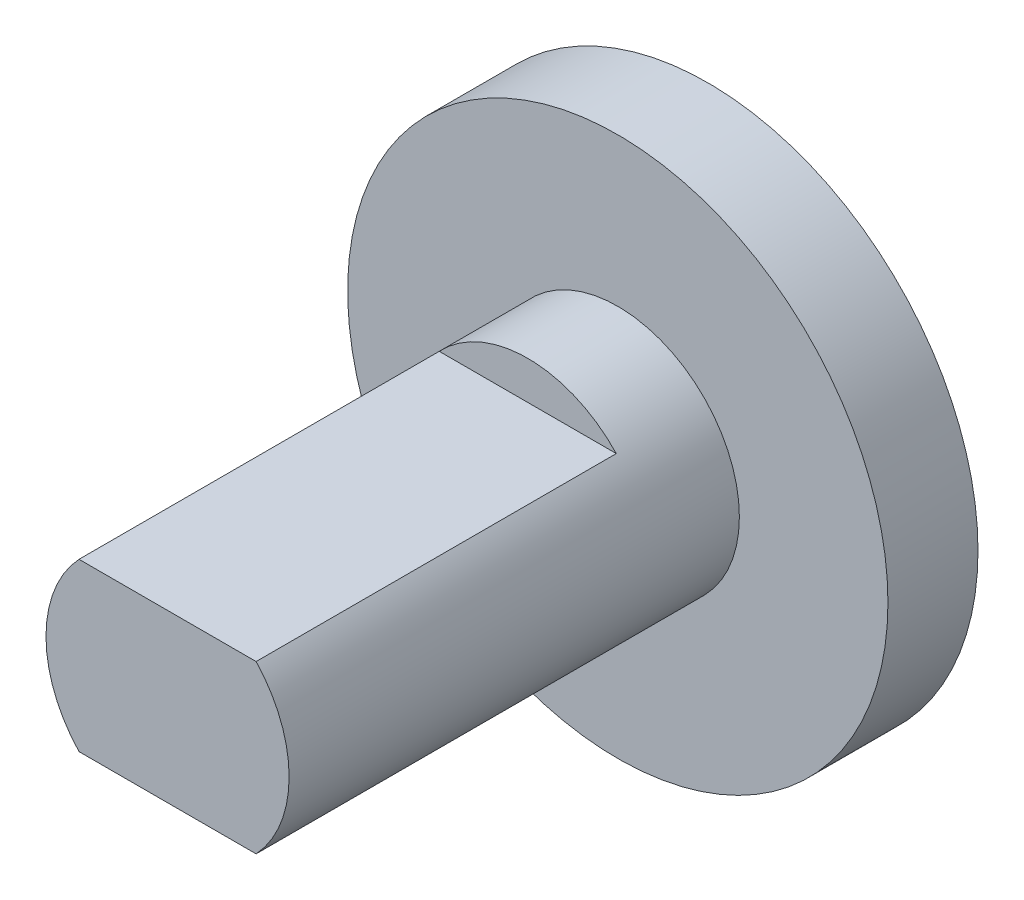
ISO-10303-21;
HEADER;
FILE_DESCRIPTION(('STEP AP214'),'2;1');
FILE_NAME('part.step','',(''),(''),'','','');
FILE_SCHEMA(('AUTOMOTIVE_DESIGN { 1 0 10303 214 1 1 1 1 }'));
ENDSEC;
DATA;
#1=APPLICATION_CONTEXT('core data for automotive mechanical design processes');
#2=APPLICATION_PROTOCOL_DEFINITION('international standard','automotive_design',2000,#1);
#3=PRODUCT_CONTEXT('',#1,'mechanical');
#4=PRODUCT('Part','Part','',(#3));
#5=PRODUCT_RELATED_PRODUCT_CATEGORY('part','',(#4));
#6=PRODUCT_DEFINITION_FORMATION('','',#4);
#7=PRODUCT_DEFINITION_CONTEXT('part definition',#1,'design');
#8=PRODUCT_DEFINITION('design','',#6,#7);
#9=PRODUCT_DEFINITION_SHAPE('','',#8);
#10=(LENGTH_UNIT() NAMED_UNIT(*) SI_UNIT(.MILLI.,.METRE.));
#11=(NAMED_UNIT(*) PLANE_ANGLE_UNIT() SI_UNIT($,.RADIAN.));
#12=(NAMED_UNIT(*) SI_UNIT($,.STERADIAN.) SOLID_ANGLE_UNIT());
#13=UNCERTAINTY_MEASURE_WITH_UNIT(LENGTH_MEASURE(1.E-05),#10,'distance_accuracy_value','');
#14=(GEOMETRIC_REPRESENTATION_CONTEXT(3) GLOBAL_UNCERTAINTY_ASSIGNED_CONTEXT((#13)) GLOBAL_UNIT_ASSIGNED_CONTEXT((#10,
#11,#12)) REPRESENTATION_CONTEXT('',''));
#15=CARTESIAN_POINT('',(0.,0.,0.));
#16=DIRECTION('',(0.,0.,1.));
#17=DIRECTION('',(1.,0.,0.));
#18=AXIS2_PLACEMENT_3D('',#15,#16,#17);
#19=CARTESIAN_POINT('',(0.,0.,0.));
#20=DIRECTION('',(0.,0.,-1.));
#21=DIRECTION('',(-1.,0.,0.));
#22=AXIS2_PLACEMENT_3D('',#19,#20,#21);
#23=PLANE('',#22);
#24=CARTESIAN_POINT('',(0.,0.,0.));
#25=DIRECTION('',(0.,0.,1.));
#26=DIRECTION('',(1.,0.,0.));
#27=AXIS2_PLACEMENT_3D('',#24,#25,#26);
#28=CIRCLE('',#27,2.7);
#29=CARTESIAN_POINT('',(1.96659604392971,-1.85,0.));
#30=VERTEX_POINT('',#29);
#31=CARTESIAN_POINT('',(1.96659604392971,1.85,0.));
#32=VERTEX_POINT('',#31);
#33=EDGE_CURVE('E73',#30,#32,#28,.T.);
#34=ORIENTED_EDGE('',*,*,#33,.T.);
#35=DIRECTION('',(1.,0.,0.));
#36=VECTOR('',#35,1.);
#37=CARTESIAN_POINT('',(-4.12392354490088,1.85,0.));
#38=LINE('',#37,#36);
#39=CARTESIAN_POINT('',(-1.96659604392971,1.85,0.));
#40=VERTEX_POINT('',#39);
#41=EDGE_CURVE('E93',#40,#32,#38,.T.);
#42=ORIENTED_EDGE('',*,*,#41,.F.);
#43=CARTESIAN_POINT('',(-1.96659604392971,-1.85,0.));
#44=VERTEX_POINT('',#43);
#45=EDGE_CURVE('E75',#40,#44,#28,.T.);
#46=ORIENTED_EDGE('',*,*,#45,.T.);
#47=DIRECTION('',(-1.,0.,0.));
#48=VECTOR('',#47,1.);
#49=CARTESIAN_POINT('',(-4.12392354490088,-1.85,0.));
#50=LINE('',#49,#48);
#51=EDGE_CURVE('E61',#30,#44,#50,.T.);
#52=ORIENTED_EDGE('',*,*,#51,.F.);
#53=EDGE_LOOP('',(#34,#42,#46,#52));
#54=FACE_BOUND('',#53,.T.);
#55=ADVANCED_FACE('F19',(#54),#23,.F.);
#56=CARTESIAN_POINT('',(0.,0.,28.327048658217));
#57=DIRECTION('',(0.,0.,1.));
#58=DIRECTION('',(1.,0.,0.));
#59=AXIS2_PLACEMENT_3D('',#56,#57,#58);
#60=CYLINDRICAL_SURFACE('',#59,2.7);
#61=CARTESIAN_POINT('',(0.,0.,-8.));
#62=DIRECTION('',(0.,0.,1.));
#63=DIRECTION('',(1.,0.,0.));
#64=AXIS2_PLACEMENT_3D('',#61,#62,#63);
#65=CIRCLE('',#64,2.7);
#66=CARTESIAN_POINT('',(1.96659604392971,1.85,-8.));
#67=VERTEX_POINT('',#66);
#68=CARTESIAN_POINT('',(-1.96659604392971,1.85,-8.));
#69=VERTEX_POINT('',#68);
#70=EDGE_CURVE('E89',#67,#69,#65,.T.);
#71=ORIENTED_EDGE('',*,*,#70,.F.);
#72=DIRECTION('',(0.,0.,1.));
#73=VECTOR('',#72,1.);
#74=CARTESIAN_POINT('',(1.96659604392971,1.85,28.327048658217));
#75=LINE('',#74,#73);
#76=EDGE_CURVE('E11',#67,#32,#75,.T.);
#77=ORIENTED_EDGE('',*,*,#76,.T.);
#78=ORIENTED_EDGE('',*,*,#33,.F.);
#79=DIRECTION('',(0.,0.,1.));
#80=VECTOR('',#79,1.);
#81=CARTESIAN_POINT('',(1.96659604392971,-1.85,28.327048658217));
#82=LINE('',#81,#80);
#83=CARTESIAN_POINT('',(1.96659604392971,-1.85,-8.));
#84=VERTEX_POINT('',#83);
#85=EDGE_CURVE('E58',#30,#84,#82,.F.);
#86=ORIENTED_EDGE('',*,*,#85,.T.);
#87=CARTESIAN_POINT('',(0.,0.,-8.));
#88=DIRECTION('',(0.,0.,-1.));
#89=DIRECTION('',(-1.,0.,0.));
#90=AXIS2_PLACEMENT_3D('',#87,#88,#89);
#91=CIRCLE('',#90,2.7);
#92=CARTESIAN_POINT('',(-1.96659604392971,-1.85,-8.));
#93=VERTEX_POINT('',#92);
#94=EDGE_CURVE('E67',#84,#93,#91,.T.);
#95=ORIENTED_EDGE('',*,*,#94,.T.);
#96=DIRECTION('',(0.,0.,1.));
#97=VECTOR('',#96,1.);
#98=CARTESIAN_POINT('',(-1.96659604392971,-1.85,28.327048658217));
#99=LINE('',#98,#97);
#100=EDGE_CURVE('E66',#93,#44,#99,.T.);
#101=ORIENTED_EDGE('',*,*,#100,.T.);
#102=ORIENTED_EDGE('',*,*,#45,.F.);
#103=DIRECTION('',(0.,0.,1.));
#104=VECTOR('',#103,1.);
#105=CARTESIAN_POINT('',(-1.96659604392971,1.85,28.327048658217));
#106=LINE('',#105,#104);
#107=EDGE_CURVE('E26',#40,#69,#106,.F.);
#108=ORIENTED_EDGE('',*,*,#107,.T.);
#109=EDGE_LOOP('',(#71,#77,#78,#86,#95,#101,#102,#108));
#110=FACE_BOUND('',#109,.T.);
#111=CARTESIAN_POINT('',(0.,0.,-10.));
#112=DIRECTION('',(0.,0.,1.));
#113=DIRECTION('',(1.,0.,0.));
#114=AXIS2_PLACEMENT_3D('',#111,#112,#113);
#115=CIRCLE('',#114,2.7);
#116=CARTESIAN_POINT('',(2.7,0.,-10.));
#117=VERTEX_POINT('',#116);
#118=EDGE_CURVE('E80',#117,#117,#115,.T.);
#119=ORIENTED_EDGE('',*,*,#118,.T.);
#120=EDGE_LOOP('',(#119));
#121=FACE_BOUND('',#120,.T.);
#122=ADVANCED_FACE('F78',(#110,#121),#60,.T.);
#123=CARTESIAN_POINT('',(0.,2.7,-10.));
#124=DIRECTION('',(0.,0.,-1.));
#125=DIRECTION('',(-1.,0.,0.));
#126=AXIS2_PLACEMENT_3D('',#123,#124,#125);
#127=PLANE('',#126);
#128=ORIENTED_EDGE('',*,*,#118,.F.);
#129=EDGE_LOOP('',(#128));
#130=FACE_BOUND('',#129,.T.);
#131=CARTESIAN_POINT('',(0.,0.,-10.));
#132=DIRECTION('',(0.,0.,1.));
#133=DIRECTION('',(1.,0.,0.));
#134=AXIS2_PLACEMENT_3D('',#131,#132,#133);
#135=CIRCLE('',#134,6.);
#136=CARTESIAN_POINT('',(6.,0.,-10.));
#137=VERTEX_POINT('',#136);
#138=EDGE_CURVE('E83',#137,#137,#135,.T.);
#139=ORIENTED_EDGE('',*,*,#138,.T.);
#140=EDGE_LOOP('',(#139));
#141=FACE_BOUND('',#140,.T.);
#142=ADVANCED_FACE('F103',(#130,#141),#127,.F.);
#143=CARTESIAN_POINT('',(0.,0.,28.327048658217));
#144=DIRECTION('',(0.,0.,1.));
#145=DIRECTION('',(1.,0.,0.));
#146=AXIS2_PLACEMENT_3D('',#143,#144,#145);
#147=CYLINDRICAL_SURFACE('',#146,6.);
#148=ORIENTED_EDGE('',*,*,#138,.F.);
#149=EDGE_LOOP('',(#148));
#150=FACE_BOUND('',#149,.T.);
#151=CARTESIAN_POINT('',(0.,0.,-12.));
#152=DIRECTION('',(0.,0.,1.));
#153=DIRECTION('',(1.,0.,0.));
#154=AXIS2_PLACEMENT_3D('',#151,#152,#153);
#155=CIRCLE('',#154,6.);
#156=CARTESIAN_POINT('',(6.,0.,-12.));
#157=VERTEX_POINT('',#156);
#158=EDGE_CURVE('E95',#157,#157,#155,.T.);
#159=ORIENTED_EDGE('',*,*,#158,.T.);
#160=EDGE_LOOP('',(#159));
#161=FACE_BOUND('',#160,.T.);
#162=ADVANCED_FACE('F105',(#150,#161),#147,.T.);
#163=CARTESIAN_POINT('',(0.,6.,-12.));
#164=DIRECTION('',(0.,0.,1.));
#165=DIRECTION('',(1.,0.,0.));
#166=AXIS2_PLACEMENT_3D('',#163,#164,#165);
#167=PLANE('',#166);
#168=ORIENTED_EDGE('',*,*,#158,.F.);
#169=EDGE_LOOP('',(#168));
#170=FACE_BOUND('',#169,.T.);
#171=ADVANCED_FACE('F108',(#170),#167,.F.);
#172=CARTESIAN_POINT('',(-4.12392354490088,-1.85,-8.));
#173=DIRECTION('',(0.,1.,0.));
#174=DIRECTION('',(0.,0.,1.));
#175=AXIS2_PLACEMENT_3D('',#172,#173,#174);
#176=PLANE('',#175);
#177=DIRECTION('',(-1.,0.,0.));
#178=VECTOR('',#177,1.);
#179=CARTESIAN_POINT('',(-4.12392354490088,-1.85,-8.));
#180=LINE('',#179,#178);
#181=EDGE_CURVE('E39',#84,#93,#180,.T.);
#182=ORIENTED_EDGE('',*,*,#181,.F.);
#183=ORIENTED_EDGE('',*,*,#85,.F.);
#184=ORIENTED_EDGE('',*,*,#51,.T.);
#185=ORIENTED_EDGE('',*,*,#100,.F.);
#186=EDGE_LOOP('',(#182,#183,#184,#185));
#187=FACE_BOUND('',#186,.T.);
#188=ADVANCED_FACE('F60',(#187),#176,.F.);
#189=CARTESIAN_POINT('',(0.,0.,-8.));
#190=DIRECTION('',(0.,0.,-1.));
#191=DIRECTION('',(-1.,0.,0.));
#192=AXIS2_PLACEMENT_3D('',#189,#190,#191);
#193=PLANE('',#192);
#194=ORIENTED_EDGE('',*,*,#181,.T.);
#195=ORIENTED_EDGE('',*,*,#94,.F.);
#196=EDGE_LOOP('',(#194,#195));
#197=FACE_BOUND('',#196,.T.);
#198=ADVANCED_FACE('F118',(#197),#193,.F.);
#199=CARTESIAN_POINT('',(-4.12392354490088,1.85,-8.));
#200=DIRECTION('',(0.,-1.,0.));
#201=DIRECTION('',(0.,0.,-1.));
#202=AXIS2_PLACEMENT_3D('',#199,#200,#201);
#203=PLANE('',#202);
#204=DIRECTION('',(1.,0.,0.));
#205=VECTOR('',#204,1.);
#206=CARTESIAN_POINT('',(-4.12392354490088,1.85,-8.));
#207=LINE('',#206,#205);
#208=EDGE_CURVE('E32',#69,#67,#207,.T.);
#209=ORIENTED_EDGE('',*,*,#208,.F.);
#210=ORIENTED_EDGE('',*,*,#107,.F.);
#211=ORIENTED_EDGE('',*,*,#41,.T.);
#212=ORIENTED_EDGE('',*,*,#76,.F.);
#213=EDGE_LOOP('',(#209,#210,#211,#212));
#214=FACE_BOUND('',#213,.T.);
#215=ADVANCED_FACE('F92',(#214),#203,.F.);
#216=CARTESIAN_POINT('',(0.,0.,-8.));
#217=DIRECTION('',(0.,0.,1.));
#218=DIRECTION('',(1.,0.,0.));
#219=AXIS2_PLACEMENT_3D('',#216,#217,#218);
#220=PLANE('',#219);
#221=ORIENTED_EDGE('',*,*,#70,.T.);
#222=ORIENTED_EDGE('',*,*,#208,.T.);
#223=EDGE_LOOP('',(#221,#222));
#224=FACE_BOUND('',#223,.T.);
#225=ADVANCED_FACE('F171',(#224),#220,.T.);
#226=CLOSED_SHELL('',(#55,#122,#142,#162,#171,#188,#198,#215,#225));
#227=MANIFOLD_SOLID_BREP('B1',#226);
#228=ADVANCED_BREP_SHAPE_REPRESENTATION('',(#18,#227),#14);
#229=SHAPE_DEFINITION_REPRESENTATION(#9,#228);
ENDSEC;
END-ISO-10303-21;
